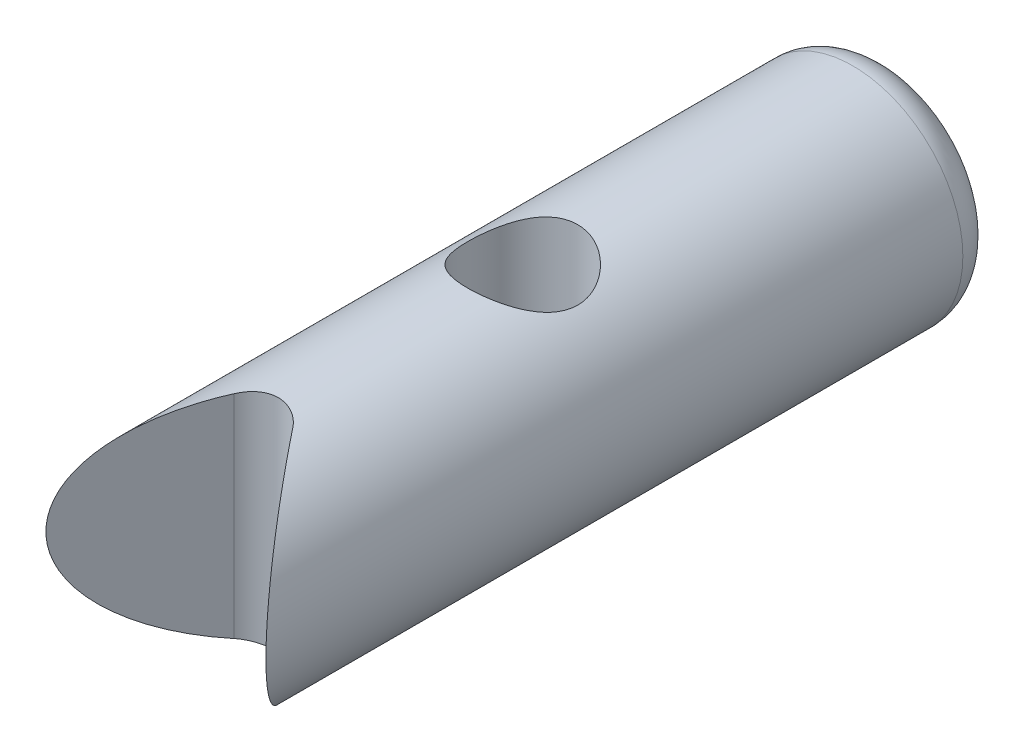
ISO-10303-21;
HEADER;
FILE_DESCRIPTION(('STEP AP214'),'2;1');
FILE_NAME('part.step','',(''),(''),'','','');
FILE_SCHEMA(('AUTOMOTIVE_DESIGN { 1 0 10303 214 1 1 1 1 }'));
ENDSEC;
DATA;
#1=APPLICATION_CONTEXT('core data for automotive mechanical design processes');
#2=APPLICATION_PROTOCOL_DEFINITION('international standard','automotive_design',2000,#1);
#3=PRODUCT_CONTEXT('',#1,'mechanical');
#4=PRODUCT('Part','Part','',(#3));
#5=PRODUCT_RELATED_PRODUCT_CATEGORY('part','',(#4));
#6=PRODUCT_DEFINITION_FORMATION('','',#4);
#7=PRODUCT_DEFINITION_CONTEXT('part definition',#1,'design');
#8=PRODUCT_DEFINITION('design','',#6,#7);
#9=PRODUCT_DEFINITION_SHAPE('','',#8);
#10=(LENGTH_UNIT() NAMED_UNIT(*) SI_UNIT(.MILLI.,.METRE.));
#11=(NAMED_UNIT(*) PLANE_ANGLE_UNIT() SI_UNIT($,.RADIAN.));
#12=(NAMED_UNIT(*) SI_UNIT($,.STERADIAN.) SOLID_ANGLE_UNIT());
#13=UNCERTAINTY_MEASURE_WITH_UNIT(LENGTH_MEASURE(1.E-05),#10,'distance_accuracy_value','');
#14=(GEOMETRIC_REPRESENTATION_CONTEXT(3) GLOBAL_UNCERTAINTY_ASSIGNED_CONTEXT((#13)) GLOBAL_UNIT_ASSIGNED_CONTEXT((#10,
#11,#12)) REPRESENTATION_CONTEXT('',''));
#15=CARTESIAN_POINT('',(0.,0.,0.));
#16=DIRECTION('',(0.,0.,1.));
#17=DIRECTION('',(1.,0.,0.));
#18=AXIS2_PLACEMENT_3D('',#15,#16,#17);
#19=CARTESIAN_POINT('',(0.,0.,20.));
#20=DIRECTION('',(0.,0.,-1.));
#21=DIRECTION('',(-1.,0.,0.));
#22=AXIS2_PLACEMENT_3D('',#19,#20,#21);
#23=CYLINDRICAL_SURFACE('',#22,3.);
#24=CARTESIAN_POINT('',(0.,0.,1.));
#25=DIRECTION('',(0.,0.,1.));
#26=DIRECTION('',(1.,0.,0.));
#27=AXIS2_PLACEMENT_3D('',#24,#25,#26);
#28=CIRCLE('',#27,3.);
#29=CARTESIAN_POINT('',(3.,0.,1.));
#30=VERTEX_POINT('',#29);
#31=EDGE_CURVE('E90',#30,#30,#28,.T.);
#32=ORIENTED_EDGE('',*,*,#31,.T.);
#33=EDGE_LOOP('',(#32));
#34=FACE_BOUND('',#33,.T.);
#35=CARTESIAN_POINT('',(0.,-3.,11.5));
#36=CARTESIAN_POINT('',(0.0788579444268501,-2.99999570107562,11.4999950465242));
#37=CARTESIAN_POINT('',(0.157809899546344,-2.99685736529634,11.4937448903184));
#38=CARTESIAN_POINT('',(0.313380352903344,-2.98461234055735,11.4690206794877));
#39=CARTESIAN_POINT('',(0.389994130070444,-2.97549431743379,11.4505234105033));
#40=CARTESIAN_POINT('',(0.538400317320673,-2.95224419105063,11.4022092870751));
#41=CARTESIAN_POINT('',(0.61021020440872,-2.93813158766306,11.372436423628));
#42=CARTESIAN_POINT('',(0.747708925209898,-2.90618664773642,11.3026440679525));
#43=CARTESIAN_POINT('',(0.813398240985089,-2.88835460450288,11.2626253836267));
#44=CARTESIAN_POINT('',(0.941261726642863,-2.84934387387093,11.1707241257721));
#45=CARTESIAN_POINT('',(1.00298281668316,-2.82802798691306,11.1182702811405));
#46=CARTESIAN_POINT('',(1.11716916730047,-2.78489955370114,11.0042177811294));
#47=CARTESIAN_POINT('',(1.16962737466015,-2.76308664313552,10.9426122223413));
#48=CARTESIAN_POINT('',(1.26787800067542,-2.71948426796021,10.8062749757149));
#49=CARTESIAN_POINT('',(1.31283800332746,-2.69782780455198,10.7308958524811));
#50=CARTESIAN_POINT('',(1.38925234033604,-2.65928968158481,10.5724489960207));
#51=CARTESIAN_POINT('',(1.4207163224495,-2.64240461410484,10.4893868069159));
#52=CARTESIAN_POINT('',(1.46719866328288,-2.61686800556713,10.3230023418671));
#53=CARTESIAN_POINT('',(1.48308878562066,-2.6077840737557,10.2399933218989));
#54=CARTESIAN_POINT('',(1.50064048996327,-2.59772834922791,10.0720317433308));
#55=CARTESIAN_POINT('',(1.50231613255961,-2.59674854014932,9.98708118869327));
#56=CARTESIAN_POINT('',(1.49203093075844,-2.60266395385873,9.82857096352695));
#57=CARTESIAN_POINT('',(1.48167683930523,-2.6086314549302,9.75486395316543));
#58=CARTESIAN_POINT('',(1.4504097735854,-2.62614343100775,9.61041713594044));
#59=CARTESIAN_POINT('',(1.42949343584648,-2.63768968247664,9.53967828204203));
#60=CARTESIAN_POINT('',(1.37731467057901,-2.66531214619111,9.40115630115151));
#61=CARTESIAN_POINT('',(1.34582260067399,-2.68148760995998,9.33348040182132));
#62=CARTESIAN_POINT('',(1.273562531502,-2.71655106422105,9.20404856111499));
#63=CARTESIAN_POINT('',(1.2327903657187,-2.73544027170286,9.14229529659987));
#64=CARTESIAN_POINT('',(1.13709908236918,-2.77669736854929,9.01821812088516));
#65=CARTESIAN_POINT('',(1.08104168755392,-2.79920265355119,8.95681468963576));
#66=CARTESIAN_POINT('',(0.959333368112061,-2.84321434950611,8.84389687211365));
#67=CARTESIAN_POINT('',(0.893677884861428,-2.86472027938201,8.79238721194918));
#68=CARTESIAN_POINT('',(0.750774758747773,-2.90552980924446,8.69847150845541));
#69=CARTESIAN_POINT('',(0.673130387399114,-2.92468476243011,8.65659929133139));
#70=CARTESIAN_POINT('',(0.510699323233196,-2.95736821681863,8.58685445643549));
#71=CARTESIAN_POINT('',(0.425918364397915,-2.9709011841533,8.55897072247725));
#72=CARTESIAN_POINT('',(0.259149737491054,-2.98986500612153,8.52028689442499));
#73=CARTESIAN_POINT('',(0.17751229582249,-2.99587407451965,8.50826314637983));
#74=CARTESIAN_POINT('',(0.0131693999240276,-3.00109520188655,8.49780290329827));
#75=CARTESIAN_POINT('',(-0.069535529804863,-3.00031048081978,8.4993599715408));
#76=CARTESIAN_POINT('',(-0.22684945797898,-2.99236788380152,8.51531003262811));
#77=CARTESIAN_POINT('',(-0.301589112074895,-2.98570868532252,8.52869879909499));
#78=CARTESIAN_POINT('',(-0.447610338452911,-2.9673325697226,8.56635710784268));
#79=CARTESIAN_POINT('',(-0.51889152853663,-2.95561509501618,8.59062784968024));
#80=CARTESIAN_POINT('',(-0.658332912674358,-2.92776377120382,8.64999769964955));
#81=CARTESIAN_POINT('',(-0.726345595508704,-2.91151322654446,8.68538657517443));
#82=CARTESIAN_POINT('',(-0.855692042548907,-2.87615961476126,8.76566130346985));
#83=CARTESIAN_POINT('',(-0.917022944664887,-2.85705533350407,8.81055120189309));
#84=CARTESIAN_POINT('',(-1.03765153393382,-2.81562332004297,8.91364063799607));
#85=CARTESIAN_POINT('',(-1.09615811672854,-2.79316327265249,8.97271430266772));
#86=CARTESIAN_POINT('',(-1.20278448167828,-2.7489358741323,9.09988772691659));
#87=CARTESIAN_POINT('',(-1.25089707856781,-2.7271690110007,9.16799367827188));
#88=CARTESIAN_POINT('',(-1.33756187171853,-2.68576788309734,9.31546548125946));
#89=CARTESIAN_POINT('',(-1.37553824370037,-2.66628794383591,9.39521689914172));
#90=CARTESIAN_POINT('',(-1.43712423890206,-2.63361108441202,9.56126510136245));
#91=CARTESIAN_POINT('',(-1.46075237380052,-2.62040607332625,9.64755328970034));
#92=CARTESIAN_POINT('',(-1.49079253120031,-2.60342251538703,9.81536533432705));
#93=CARTESIAN_POINT('',(-1.49863949460818,-2.59886075197597,9.89655138015286));
#94=CARTESIAN_POINT('',(-1.5010337315643,-2.59748031962405,10.0591706007468));
#95=CARTESIAN_POINT('',(-1.49558676993486,-2.60065829439585,10.1406036531068));
#96=CARTESIAN_POINT('',(-1.47288918838996,-2.61356793076615,10.2932252523002));
#97=CARTESIAN_POINT('',(-1.45681247151455,-2.62264641723987,10.3646507052171));
#98=CARTESIAN_POINT('',(-1.41476303733662,-2.64556524281479,10.5037121791365));
#99=CARTESIAN_POINT('',(-1.38878713673988,-2.65940711354502,10.571346973138));
#100=CARTESIAN_POINT('',(-1.32572361795085,-2.69142795546803,10.7059372764798));
#101=CARTESIAN_POINT('',(-1.28800670672355,-2.70983583593881,10.7725418527435));
#102=CARTESIAN_POINT('',(-1.20322645745609,-2.7485299745229,10.8989118042719));
#103=CARTESIAN_POINT('',(-1.15615825686234,-2.76881720693416,10.9586735957817));
#104=CARTESIAN_POINT('',(-1.04730498999206,-2.81193484737138,11.077212973532));
#105=CARTESIAN_POINT('',(-0.984426634495892,-2.83477474959942,11.1349886535254));
#106=CARTESIAN_POINT('',(-0.849232209349796,-2.87816628389896,11.2393944751529));
#107=CARTESIAN_POINT('',(-0.776911084957796,-2.89871667939292,11.2860186092049));
#108=CARTESIAN_POINT('',(-0.623897395174419,-2.93547014349806,11.3668545440681));
#109=CARTESIAN_POINT('',(-0.543149255665097,-2.95164144740899,11.4009762538547));
#110=CARTESIAN_POINT('',(-0.376113151707131,-2.9775201194848,11.4547122516361));
#111=CARTESIAN_POINT('',(-0.289841699383651,-2.98724585044602,11.4743677702086));
#112=CARTESIAN_POINT('',(-0.168902919736343,-2.99543192870217,11.4908461166286));
#113=CARTESIAN_POINT('',(-0.135242819162347,-2.99714048010376,11.4942739612995));
#114=CARTESIAN_POINT('',(-0.067727597707637,-2.99942545465223,11.4988519982711));
#115=CARTESIAN_POINT('',(-0.0338724714699425,-3.00000184655071,11.5000021277053));
#116=CARTESIAN_POINT('',(0.,-3.,11.5));
#117=B_SPLINE_CURVE_WITH_KNOTS('',3,(#35,#36,#37,#38,#39,#40,#41,#42,#43,#44,#45,#46,#47,#48,
#49,#50,#51,#52,#53,#54,#55,#56,#57,#58,#59,#60,#61,#62,#63,#64,#65,#66,#67,#68,#69,#70,#71,#72,
#73,#74,#75,#76,#77,#78,#79,#80,#81,#82,#83,#84,#85,#86,#87,#88,#89,#90,#91,#92,#93,#94,#95,#96,
#97,#98,#99,#100,#101,#102,#103,#104,#105,#106,#107,#108,#109,#110,#111,#112,#113,#114,#115,
#116),.UNSPECIFIED.,.T.,.F.,(4,2,2,2,2,2,2,2,2,2,2,2,2,2,2,2,2,2,2,2,2,2,2,2,2,2,2,2,2,2,2,2,2,
2,2,2,2,2,2,2,4),(0.,0.236436386130439,0.473322224563796,0.709293233238448,0.945245640872351,
1.19547263807713,1.44588935648105,1.71572589646129,1.98536921847421,2.23887018210344,
2.49212035993531,2.71508568613981,2.93812205888517,3.16635360252731,3.39468781890333,
3.65197412000818,3.90938301898029,4.17874533321661,4.44789325368419,4.69474935707018,
4.94148846767214,5.16910359759183,5.39674382446397,5.63089284041848,5.86514176122509,
6.12239415966628,6.37982382923148,6.64972023242589,6.91926767918176,7.1629396125457,
7.40650589797017,7.62686895373283,7.84730293182526,8.08254685170431,8.31791341715446,
8.58187864135757,8.84598575071868,9.11196020495289,9.37717362931723,9.47872920200875,
9.58028757766599),.UNSPECIFIED.);
#118=CARTESIAN_POINT('',(0.,-3.,11.5));
#119=VERTEX_POINT('',#118);
#120=EDGE_CURVE('E114',#119,#119,#117,.T.);
#121=ORIENTED_EDGE('',*,*,#120,.T.);
#122=EDGE_LOOP('',(#121));
#123=FACE_BOUND('',#122,.T.);
#124=CARTESIAN_POINT('',(0.,3.,11.5));
#125=CARTESIAN_POINT('',(-0.0788579444268501,2.99999570107562,11.4999950465242));
#126=CARTESIAN_POINT('',(-0.157809899546344,2.99685736529634,11.4937448903184));
#127=CARTESIAN_POINT('',(-0.313380352903344,2.98461234055735,11.4690206794877));
#128=CARTESIAN_POINT('',(-0.389994130070444,2.97549431743379,11.4505234105033));
#129=CARTESIAN_POINT('',(-0.538400317320673,2.95224419105063,11.4022092870751));
#130=CARTESIAN_POINT('',(-0.61021020440872,2.93813158766306,11.372436423628));
#131=CARTESIAN_POINT('',(-0.747708925209898,2.90618664773642,11.3026440679525));
#132=CARTESIAN_POINT('',(-0.813398240985089,2.88835460450288,11.2626253836267));
#133=CARTESIAN_POINT('',(-0.941261726642863,2.84934387387093,11.1707241257721));
#134=CARTESIAN_POINT('',(-1.00298281668316,2.82802798691306,11.1182702811405));
#135=CARTESIAN_POINT('',(-1.11716916730047,2.78489955370114,11.0042177811294));
#136=CARTESIAN_POINT('',(-1.16962737466015,2.76308664313552,10.9426122223413));
#137=CARTESIAN_POINT('',(-1.26787800067542,2.71948426796021,10.8062749757149));
#138=CARTESIAN_POINT('',(-1.31283800332746,2.69782780455198,10.7308958524811));
#139=CARTESIAN_POINT('',(-1.38925234033604,2.65928968158481,10.5724489960207));
#140=CARTESIAN_POINT('',(-1.4207163224495,2.64240461410484,10.4893868069159));
#141=CARTESIAN_POINT('',(-1.46719866328288,2.61686800556713,10.3230023418671));
#142=CARTESIAN_POINT('',(-1.48308878562066,2.6077840737557,10.2399933218989));
#143=CARTESIAN_POINT('',(-1.50064048996327,2.59772834922791,10.0720317433308));
#144=CARTESIAN_POINT('',(-1.50231613255961,2.59674854014932,9.98708118869327));
#145=CARTESIAN_POINT('',(-1.49203093075844,2.60266395385873,9.82857096352695));
#146=CARTESIAN_POINT('',(-1.48167683930523,2.6086314549302,9.75486395316543));
#147=CARTESIAN_POINT('',(-1.4504097735854,2.62614343100775,9.61041713594044));
#148=CARTESIAN_POINT('',(-1.42949343584648,2.63768968247664,9.53967828204203));
#149=CARTESIAN_POINT('',(-1.37731467057901,2.66531214619111,9.40115630115151));
#150=CARTESIAN_POINT('',(-1.34582260067399,2.68148760995998,9.33348040182132));
#151=CARTESIAN_POINT('',(-1.273562531502,2.71655106422105,9.20404856111499));
#152=CARTESIAN_POINT('',(-1.2327903657187,2.73544027170286,9.14229529659987));
#153=CARTESIAN_POINT('',(-1.13709908236918,2.77669736854929,9.01821812088516));
#154=CARTESIAN_POINT('',(-1.08104168755392,2.79920265355119,8.95681468963576));
#155=CARTESIAN_POINT('',(-0.959333368112061,2.84321434950611,8.84389687211365));
#156=CARTESIAN_POINT('',(-0.893677884861428,2.86472027938201,8.79238721194918));
#157=CARTESIAN_POINT('',(-0.750774758747773,2.90552980924446,8.69847150845541));
#158=CARTESIAN_POINT('',(-0.673130387399114,2.92468476243011,8.65659929133139));
#159=CARTESIAN_POINT('',(-0.510699323233196,2.95736821681863,8.58685445643549));
#160=CARTESIAN_POINT('',(-0.425918364397915,2.9709011841533,8.55897072247725));
#161=CARTESIAN_POINT('',(-0.259149737491054,2.98986500612153,8.52028689442499));
#162=CARTESIAN_POINT('',(-0.17751229582249,2.99587407451965,8.50826314637983));
#163=CARTESIAN_POINT('',(-0.0131693999240276,3.00109520188655,8.49780290329827));
#164=CARTESIAN_POINT('',(0.069535529804863,3.00031048081978,8.4993599715408));
#165=CARTESIAN_POINT('',(0.22684945797898,2.99236788380152,8.51531003262811));
#166=CARTESIAN_POINT('',(0.301589112074895,2.98570868532252,8.52869879909499));
#167=CARTESIAN_POINT('',(0.447610338452911,2.9673325697226,8.56635710784268));
#168=CARTESIAN_POINT('',(0.51889152853663,2.95561509501618,8.59062784968024));
#169=CARTESIAN_POINT('',(0.658332912674358,2.92776377120382,8.64999769964955));
#170=CARTESIAN_POINT('',(0.726345595508704,2.91151322654446,8.68538657517443));
#171=CARTESIAN_POINT('',(0.855692042548907,2.87615961476126,8.76566130346985));
#172=CARTESIAN_POINT('',(0.917022944664887,2.85705533350407,8.81055120189309));
#173=CARTESIAN_POINT('',(1.03765153393382,2.81562332004297,8.91364063799607));
#174=CARTESIAN_POINT('',(1.09615811672854,2.79316327265249,8.97271430266772));
#175=CARTESIAN_POINT('',(1.20278448167828,2.7489358741323,9.09988772691659));
#176=CARTESIAN_POINT('',(1.25089707856781,2.7271690110007,9.16799367827188));
#177=CARTESIAN_POINT('',(1.33756187171853,2.68576788309734,9.31546548125946));
#178=CARTESIAN_POINT('',(1.37553824370037,2.66628794383591,9.39521689914172));
#179=CARTESIAN_POINT('',(1.43712423890206,2.63361108441202,9.56126510136245));
#180=CARTESIAN_POINT('',(1.46075237380052,2.62040607332625,9.64755328970034));
#181=CARTESIAN_POINT('',(1.49079253120031,2.60342251538703,9.81536533432705));
#182=CARTESIAN_POINT('',(1.49863949460818,2.59886075197597,9.89655138015286));
#183=CARTESIAN_POINT('',(1.5010337315643,2.59748031962405,10.0591706007468));
#184=CARTESIAN_POINT('',(1.49558676993486,2.60065829439585,10.1406036531068));
#185=CARTESIAN_POINT('',(1.47288918838996,2.61356793076615,10.2932252523002));
#186=CARTESIAN_POINT('',(1.45681247151455,2.62264641723987,10.3646507052171));
#187=CARTESIAN_POINT('',(1.41476303733662,2.64556524281479,10.5037121791365));
#188=CARTESIAN_POINT('',(1.38878713673988,2.65940711354502,10.571346973138));
#189=CARTESIAN_POINT('',(1.32572361795085,2.69142795546803,10.7059372764798));
#190=CARTESIAN_POINT('',(1.28800670672355,2.70983583593881,10.7725418527435));
#191=CARTESIAN_POINT('',(1.20322645745609,2.7485299745229,10.8989118042719));
#192=CARTESIAN_POINT('',(1.15615825686234,2.76881720693416,10.9586735957817));
#193=CARTESIAN_POINT('',(1.04730498999206,2.81193484737138,11.077212973532));
#194=CARTESIAN_POINT('',(0.984426634495892,2.83477474959942,11.1349886535254));
#195=CARTESIAN_POINT('',(0.849232209349796,2.87816628389896,11.2393944751529));
#196=CARTESIAN_POINT('',(0.776911084957796,2.89871667939292,11.2860186092049));
#197=CARTESIAN_POINT('',(0.623897395174419,2.93547014349806,11.3668545440681));
#198=CARTESIAN_POINT('',(0.543149255665097,2.95164144740899,11.4009762538547));
#199=CARTESIAN_POINT('',(0.376113151707131,2.9775201194848,11.4547122516361));
#200=CARTESIAN_POINT('',(0.289841699383651,2.98724585044602,11.4743677702086));
#201=CARTESIAN_POINT('',(0.168902919736343,2.99543192870217,11.4908461166286));
#202=CARTESIAN_POINT('',(0.135242819162347,2.99714048010376,11.4942739612995));
#203=CARTESIAN_POINT('',(0.067727597707637,2.99942545465223,11.4988519982711));
#204=CARTESIAN_POINT('',(0.0338724714699425,3.00000184655071,11.5000021277053));
#205=CARTESIAN_POINT('',(0.,3.,11.5));
#206=B_SPLINE_CURVE_WITH_KNOTS('',3,(#124,#125,#126,#127,#128,#129,#130,#131,#132,#133,#134,
#135,#136,#137,#138,#139,#140,#141,#142,#143,#144,#145,#146,#147,#148,#149,#150,#151,#152,#153,
#154,#155,#156,#157,#158,#159,#160,#161,#162,#163,#164,#165,#166,#167,#168,#169,#170,#171,#172,
#173,#174,#175,#176,#177,#178,#179,#180,#181,#182,#183,#184,#185,#186,#187,#188,#189,#190,#191,
#192,#193,#194,#195,#196,#197,#198,#199,#200,#201,#202,#203,#204,#205),.UNSPECIFIED.,.T.,.F.,(4,
2,2,2,2,2,2,2,2,2,2,2,2,2,2,2,2,2,2,2,2,2,2,2,2,2,2,2,2,2,2,2,2,2,2,2,2,2,2,2,4),(0.,
0.236436386130439,0.473322224563796,0.709293233238448,0.945245640872351,1.19547263807713,
1.44588935648105,1.71572589646129,1.98536921847421,2.23887018210344,2.49212035993531,
2.71508568613981,2.93812205888517,3.16635360252731,3.39468781890333,3.65197412000818,
3.90938301898029,4.17874533321661,4.44789325368419,4.69474935707018,4.94148846767214,
5.16910359759183,5.39674382446397,5.63089284041848,5.86514176122509,6.12239415966628,
6.37982382923148,6.64972023242589,6.91926767918176,7.1629396125457,7.40650589797017,
7.62686895373283,7.84730293182526,8.08254685170431,8.31791341715446,8.58187864135757,
8.84598575071868,9.11196020495289,9.37717362931723,9.47872920200875,9.58028757766599),.UNSPECIFIED.);
#207=CARTESIAN_POINT('',(0.,3.,11.5));
#208=VERTEX_POINT('',#207);
#209=EDGE_CURVE('E81',#208,#208,#206,.T.);
#210=ORIENTED_EDGE('',*,*,#209,.T.);
#211=EDGE_LOOP('',(#210));
#212=FACE_BOUND('',#211,.T.);
#213=CARTESIAN_POINT('',(0.,0.,16.));
#214=DIRECTION('',(0.8,0.,-0.6));
#215=DIRECTION('',(-0.6,0.,-0.8));
#216=AXIS2_PLACEMENT_3D('',#213,#214,#215);
#217=ELLIPSE('',#216,5.,3.);
#218=CARTESIAN_POINT('',(0.8,2.89136645896019,17.0666666666667));
#219=VERTEX_POINT('',#218);
#220=CARTESIAN_POINT('',(0.8,-2.89136645896019,17.0666666666667));
#221=VERTEX_POINT('',#220);
#222=EDGE_CURVE('E73',#219,#221,#217,.T.);
#223=ORIENTED_EDGE('',*,*,#222,.T.);
#224=CARTESIAN_POINT('',(0.8,-2.89136645896019,17.0666666666667));
#225=CARTESIAN_POINT('',(0.766118290998834,-2.90075601056195,17.0214444689864));
#226=CARTESIAN_POINT('',(0.728402941231284,-2.91053777533424,16.9791842212711));
#227=CARTESIAN_POINT('',(0.646324861244811,-2.92984948997133,16.9015227190962));
#228=CARTESIAN_POINT('',(0.601954044929092,-2.93937911669873,16.8661299299508));
#229=CARTESIAN_POINT('',(0.507625762005629,-2.95713109356317,16.8032224356505));
#230=CARTESIAN_POINT('',(0.457662720992858,-2.96535211914321,16.7757156904228));
#231=CARTESIAN_POINT('',(0.353555831004425,-2.97955532162685,16.7295245190957));
#232=CARTESIAN_POINT('',(0.299415874736617,-2.98553955343415,16.7108319913772));
#233=CARTESIAN_POINT('',(0.190046403449954,-2.99446287955378,16.6833187313428));
#234=CARTESIAN_POINT('',(0.134888953039075,-2.99748195972824,16.6742381530726));
#235=CARTESIAN_POINT('',(0.0237424855507382,-3.00042067926385,16.6653960889427));
#236=CARTESIAN_POINT('',(-0.032246524057548,-3.00034034644752,16.6656345194289));
#237=CARTESIAN_POINT('',(-0.141112886688259,-2.99715504755263,16.6752251799936));
#238=CARTESIAN_POINT('',(-0.194025961154823,-2.99416928973733,16.6842182183556));
#239=CARTESIAN_POINT('',(-0.297545995834885,-2.98565988938253,16.7104668717012));
#240=CARTESIAN_POINT('',(-0.348152726251505,-2.98013599455607,16.7277233080611));
#241=CARTESIAN_POINT('',(-0.446395163083182,-2.96702249923409,16.7702097444947));
#242=CARTESIAN_POINT('',(-0.493983303827638,-2.95940680355068,16.7955411679618));
#243=CARTESIAN_POINT('',(-0.584322899581693,-2.9429025525491,16.8533766189069));
#244=CARTESIAN_POINT('',(-0.627075959198639,-2.93401442174301,16.8858782561939));
#245=CARTESIAN_POINT('',(-0.691440974386521,-2.91933984002625,16.943482791057));
#246=CARTESIAN_POINT('',(-0.714863272583289,-2.91367411313092,16.9666287700147));
#247=CARTESIAN_POINT('',(-0.759278845082511,-2.90241607089668,17.0150740579022));
#248=CARTESIAN_POINT('',(-0.780276816567835,-2.89682363286162,17.040369032154));
#249=CARTESIAN_POINT('',(-0.799999999999999,-2.89136645896019,17.0666666666667));
#250=B_SPLINE_CURVE_WITH_KNOTS('',3,(#224,#225,#226,#227,#228,#229,#230,#231,#232,#233,#234,
#235,#236,#237,#238,#239,#240,#241,#242,#243,#244,#245,#246,#247,#248,#249),.UNSPECIFIED.,.F.,
.F.,(4,2,2,2,2,2,2,2,2,2,2,2,4),(0.,0.17164182898405,0.343493910105099,0.51551884752604,
0.687385357909967,0.854476773923434,1.02156669000664,1.18207805910475,1.34260538624222,
1.50523415058803,1.6678087843305,1.76790412262005,1.86780214863766),.UNSPECIFIED.);
#251=CARTESIAN_POINT('',(-0.8,-2.89136645896019,17.0666666666667));
#252=VERTEX_POINT('',#251);
#253=EDGE_CURVE('E11',#221,#252,#250,.T.);
#254=ORIENTED_EDGE('',*,*,#253,.T.);
#255=CARTESIAN_POINT('',(0.,0.,16.));
#256=DIRECTION('',(-0.8,0.,-0.6));
#257=DIRECTION('',(0.6,0.,-0.8));
#258=AXIS2_PLACEMENT_3D('',#255,#256,#257);
#259=ELLIPSE('',#258,5.,3.);
#260=CARTESIAN_POINT('',(-0.8,2.89136645896019,17.0666666666667));
#261=VERTEX_POINT('',#260);
#262=EDGE_CURVE('E72',#252,#261,#259,.T.);
#263=ORIENTED_EDGE('',*,*,#262,.T.);
#264=CARTESIAN_POINT('',(-0.8,2.89136645896019,17.0666666666667));
#265=CARTESIAN_POINT('',(-0.766118290998834,2.90075601056195,17.0214444689864));
#266=CARTESIAN_POINT('',(-0.728402941231284,2.91053777533424,16.9791842212711));
#267=CARTESIAN_POINT('',(-0.646324861244811,2.92984948997133,16.9015227190962));
#268=CARTESIAN_POINT('',(-0.601954044929092,2.93937911669873,16.8661299299508));
#269=CARTESIAN_POINT('',(-0.507625762005629,2.95713109356317,16.8032224356505));
#270=CARTESIAN_POINT('',(-0.457662720992859,2.96535211914322,16.7757156904228));
#271=CARTESIAN_POINT('',(-0.353555831004425,2.97955532162685,16.7295245190957));
#272=CARTESIAN_POINT('',(-0.299415874736618,2.98553955343415,16.7108319913772));
#273=CARTESIAN_POINT('',(-0.190046403449953,2.99446287955378,16.6833187313428));
#274=CARTESIAN_POINT('',(-0.134888953039075,2.99748195972824,16.6742381530726));
#275=CARTESIAN_POINT('',(-0.023742485550738,3.00042067926385,16.6653960889427));
#276=CARTESIAN_POINT('',(0.0322465240575482,3.00034034644752,16.6656345194289));
#277=CARTESIAN_POINT('',(0.141112886688259,2.99715504755263,16.6752251799936));
#278=CARTESIAN_POINT('',(0.194025961154824,2.99416928973733,16.6842182183556));
#279=CARTESIAN_POINT('',(0.297545995834885,2.98565988938253,16.7104668717012));
#280=CARTESIAN_POINT('',(0.348152726251505,2.98013599455607,16.7277233080611));
#281=CARTESIAN_POINT('',(0.446395163083183,2.96702249923409,16.7702097444947));
#282=CARTESIAN_POINT('',(0.493983303827638,2.95940680355068,16.7955411679618));
#283=CARTESIAN_POINT('',(0.584322899581694,2.9429025525491,16.8533766189069));
#284=CARTESIAN_POINT('',(0.627075959198639,2.93401442174301,16.8858782561939));
#285=CARTESIAN_POINT('',(0.691440974386521,2.91933984002625,16.943482791057));
#286=CARTESIAN_POINT('',(0.714863272583289,2.91367411313092,16.9666287700147));
#287=CARTESIAN_POINT('',(0.759278845082511,2.90241607089668,17.0150740579022));
#288=CARTESIAN_POINT('',(0.780276816567835,2.89682363286162,17.040369032154));
#289=CARTESIAN_POINT('',(0.799999999999999,2.89136645896019,17.0666666666667));
#290=B_SPLINE_CURVE_WITH_KNOTS('',3,(#264,#265,#266,#267,#268,#269,#270,#271,#272,#273,#274,
#275,#276,#277,#278,#279,#280,#281,#282,#283,#284,#285,#286,#287,#288,#289),.UNSPECIFIED.,.F.,
.F.,(4,2,2,2,2,2,2,2,2,2,2,2,4),(0.,0.17164182898405,0.343493910105099,0.515518847526039,
0.687385357909967,0.854476773923434,1.02156669000664,1.18207805910475,1.34260538624222,
1.50523415058803,1.6678087843305,1.76790412262005,1.86780214863766),.UNSPECIFIED.);
#291=EDGE_CURVE('E54',#261,#219,#290,.T.);
#292=ORIENTED_EDGE('',*,*,#291,.T.);
#293=EDGE_LOOP('',(#223,#254,#263,#292));
#294=FACE_BOUND('',#293,.T.);
#295=ADVANCED_FACE('F39',(#34,#123,#212,#294),#23,.T.);
#296=CARTESIAN_POINT('',(0.,0.,0.));
#297=DIRECTION('',(0.,0.,1.));
#298=DIRECTION('',(1.,0.,0.));
#299=AXIS2_PLACEMENT_3D('',#296,#297,#298);
#300=PLANE('',#299);
#301=CARTESIAN_POINT('',(0.,0.,0.));
#302=DIRECTION('',(0.,0.,1.));
#303=DIRECTION('',(1.,0.,0.));
#304=AXIS2_PLACEMENT_3D('',#301,#302,#303);
#305=CIRCLE('',#304,2.);
#306=CARTESIAN_POINT('',(2.,0.,0.));
#307=VERTEX_POINT('',#306);
#308=EDGE_CURVE('E84',#307,#307,#305,.F.);
#309=ORIENTED_EDGE('',*,*,#308,.T.);
#310=EDGE_LOOP('',(#309));
#311=FACE_BOUND('',#310,.T.);
#312=ADVANCED_FACE('F101',(#311),#300,.F.);
#313=CARTESIAN_POINT('',(-3.,-3.,20.));
#314=DIRECTION('',(-0.8,0.,-0.6));
#315=DIRECTION('',(-0.6,0.,0.8));
#316=AXIS2_PLACEMENT_3D('',#313,#314,#315);
#317=PLANE('',#316);
#318=ORIENTED_EDGE('',*,*,#262,.F.);
#319=DIRECTION('',(0.,1.,0.));
#320=VECTOR('',#319,1.);
#321=CARTESIAN_POINT('',(-0.8,3.,17.0666666666667));
#322=LINE('',#321,#320);
#323=EDGE_CURVE('E79',#252,#261,#322,.T.);
#324=ORIENTED_EDGE('',*,*,#323,.T.);
#325=EDGE_LOOP('',(#318,#324));
#326=FACE_BOUND('',#325,.T.);
#327=ADVANCED_FACE('F78',(#326),#317,.F.);
#328=CARTESIAN_POINT('',(0.,-3.,16.));
#329=DIRECTION('',(0.8,0.,-0.6));
#330=DIRECTION('',(-0.6,0.,-0.8));
#331=AXIS2_PLACEMENT_3D('',#328,#329,#330);
#332=PLANE('',#331);
#333=ORIENTED_EDGE('',*,*,#222,.F.);
#334=DIRECTION('',(0.,1.,0.));
#335=VECTOR('',#334,1.);
#336=CARTESIAN_POINT('',(0.8,-3.,17.0666666666667));
#337=LINE('',#336,#335);
#338=EDGE_CURVE('E60',#219,#221,#337,.F.);
#339=ORIENTED_EDGE('',*,*,#338,.T.);
#340=EDGE_LOOP('',(#333,#339));
#341=FACE_BOUND('',#340,.T.);
#342=ADVANCED_FACE('F124',(#341),#332,.F.);
#343=CARTESIAN_POINT('',(0.,-3.,10.));
#344=DIRECTION('',(0.,1.,0.));
#345=DIRECTION('',(0.,0.,1.));
#346=AXIS2_PLACEMENT_3D('',#343,#344,#345);
#347=CYLINDRICAL_SURFACE('',#346,1.5);
#348=ORIENTED_EDGE('',*,*,#209,.F.);
#349=EDGE_LOOP('',(#348));
#350=FACE_BOUND('',#349,.T.);
#351=ORIENTED_EDGE('',*,*,#120,.F.);
#352=EDGE_LOOP('',(#351));
#353=FACE_BOUND('',#352,.T.);
#354=ADVANCED_FACE('F120',(#350,#353),#347,.F.);
#355=CARTESIAN_POINT('',(0.,0.,1.));
#356=DIRECTION('',(0.,0.,1.));
#357=DIRECTION('',(1.,0.,0.));
#358=AXIS2_PLACEMENT_3D('',#355,#356,#357);
#359=TOROIDAL_SURFACE('',#358,2.,1.);
#360=ORIENTED_EDGE('',*,*,#308,.F.);
#361=EDGE_LOOP('',(#360));
#362=FACE_BOUND('',#361,.T.);
#363=ORIENTED_EDGE('',*,*,#31,.F.);
#364=EDGE_LOOP('',(#363));
#365=FACE_BOUND('',#364,.T.);
#366=ADVANCED_FACE('F104',(#362,#365),#359,.T.);
#367=CARTESIAN_POINT('',(0.,-3.,17.6666666666667));
#368=DIRECTION('',(0.,-1.,0.));
#369=DIRECTION('',(0.,0.,-1.));
#370=AXIS2_PLACEMENT_3D('',#367,#368,#369);
#371=CYLINDRICAL_SURFACE('',#370,1.);
#372=ORIENTED_EDGE('',*,*,#253,.F.);
#373=ORIENTED_EDGE('',*,*,#338,.F.);
#374=ORIENTED_EDGE('',*,*,#291,.F.);
#375=ORIENTED_EDGE('',*,*,#323,.F.);
#376=EDGE_LOOP('',(#372,#373,#374,#375));
#377=FACE_BOUND('',#376,.T.);
#378=ADVANCED_FACE('F41',(#377),#371,.F.);
#379=CLOSED_SHELL('',(#295,#312,#327,#342,#354,#366,#378));
#380=MANIFOLD_SOLID_BREP('B2',#379);
#381=ADVANCED_BREP_SHAPE_REPRESENTATION('',(#18,#380),#14);
#382=SHAPE_DEFINITION_REPRESENTATION(#9,#381);
ENDSEC;
END-ISO-10303-21;
